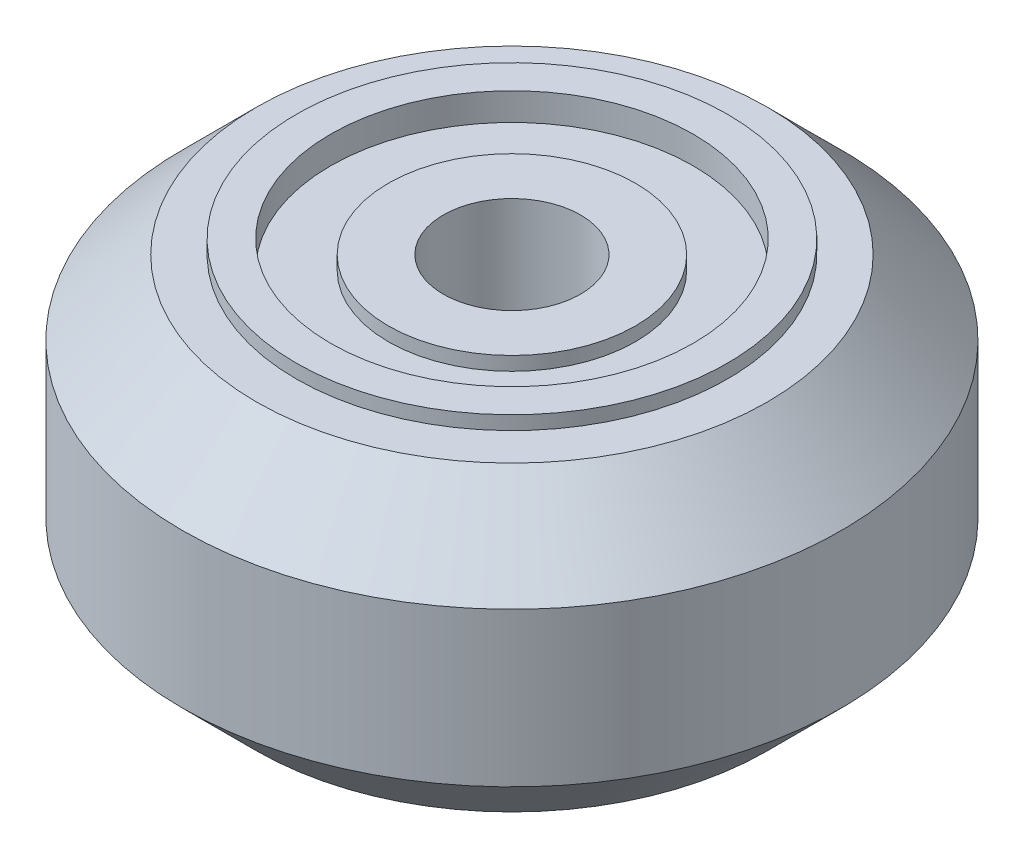
ISO-10303-21;
HEADER;
FILE_DESCRIPTION(('STEP AP214'),'2;1');
FILE_NAME('part.step','',(''),(''),'','','');
FILE_SCHEMA(('AUTOMOTIVE_DESIGN { 1 0 10303 214 1 1 1 1 }'));
ENDSEC;
DATA;
#1=APPLICATION_CONTEXT('core data for automotive mechanical design processes');
#2=APPLICATION_PROTOCOL_DEFINITION('international standard','automotive_design',2000,#1);
#3=PRODUCT_CONTEXT('',#1,'mechanical');
#4=PRODUCT('Part','Part','',(#3));
#5=PRODUCT_RELATED_PRODUCT_CATEGORY('part','',(#4));
#6=PRODUCT_DEFINITION_FORMATION('','',#4);
#7=PRODUCT_DEFINITION_CONTEXT('part definition',#1,'design');
#8=PRODUCT_DEFINITION('design','',#6,#7);
#9=PRODUCT_DEFINITION_SHAPE('','',#8);
#10=(LENGTH_UNIT() NAMED_UNIT(*) SI_UNIT(.MILLI.,.METRE.));
#11=(NAMED_UNIT(*) PLANE_ANGLE_UNIT() SI_UNIT($,.RADIAN.));
#12=(NAMED_UNIT(*) SI_UNIT($,.STERADIAN.) SOLID_ANGLE_UNIT());
#13=UNCERTAINTY_MEASURE_WITH_UNIT(LENGTH_MEASURE(1.E-05),#10,'distance_accuracy_value','');
#14=(GEOMETRIC_REPRESENTATION_CONTEXT(3) GLOBAL_UNCERTAINTY_ASSIGNED_CONTEXT((#13)) GLOBAL_UNIT_ASSIGNED_CONTEXT((#10,
#11,#12)) REPRESENTATION_CONTEXT('',''));
#15=CARTESIAN_POINT('',(0.,0.,0.));
#16=DIRECTION('',(0.,0.,1.));
#17=DIRECTION('',(1.,0.,0.));
#18=AXIS2_PLACEMENT_3D('',#15,#16,#17);
#19=CARTESIAN_POINT('',(0.,11.,0.));
#20=DIRECTION('',(0.,1.,0.));
#21=DIRECTION('',(0.,0.,1.));
#22=AXIS2_PLACEMENT_3D('',#19,#20,#21);
#23=PLANE('',#22);
#24=CARTESIAN_POINT('',(0.,11.,0.));
#25=DIRECTION('',(0.,-1.,0.));
#26=DIRECTION('',(0.,0.,-1.));
#27=AXIS2_PLACEMENT_3D('',#24,#25,#26);
#28=CIRCLE('',#27,2.5);
#29=CARTESIAN_POINT('',(0.,11.,-2.5));
#30=VERTEX_POINT('',#29);
#31=EDGE_CURVE('E68',#30,#30,#28,.T.);
#32=ORIENTED_EDGE('',*,*,#31,.T.);
#33=EDGE_LOOP('',(#32));
#34=FACE_BOUND('',#33,.T.);
#35=CARTESIAN_POINT('',(0.,11.,0.));
#36=DIRECTION('',(0.,-1.,0.));
#37=DIRECTION('',(0.,0.,-1.));
#38=AXIS2_PLACEMENT_3D('',#35,#36,#37);
#39=CIRCLE('',#38,4.5);
#40=CARTESIAN_POINT('',(0.,11.,-4.5));
#41=VERTEX_POINT('',#40);
#42=EDGE_CURVE('E127',#41,#41,#39,.T.);
#43=ORIENTED_EDGE('',*,*,#42,.F.);
#44=EDGE_LOOP('',(#43));
#45=FACE_BOUND('',#44,.T.);
#46=ADVANCED_FACE('F47',(#34,#45),#23,.T.);
#47=CARTESIAN_POINT('',(0.,0.,0.));
#48=DIRECTION('',(0.,1.,0.));
#49=DIRECTION('',(0.,0.,1.));
#50=AXIS2_PLACEMENT_3D('',#47,#48,#49);
#51=PLANE('',#50);
#52=CARTESIAN_POINT('',(0.,0.,0.));
#53=DIRECTION('',(0.,-1.,0.));
#54=DIRECTION('',(0.,0.,-1.));
#55=AXIS2_PLACEMENT_3D('',#52,#53,#54);
#56=CIRCLE('',#55,2.5);
#57=CARTESIAN_POINT('',(0.,0.,-2.5));
#58=VERTEX_POINT('',#57);
#59=EDGE_CURVE('E73',#58,#58,#56,.T.);
#60=ORIENTED_EDGE('',*,*,#59,.F.);
#61=EDGE_LOOP('',(#60));
#62=FACE_BOUND('',#61,.T.);
#63=CARTESIAN_POINT('',(0.,0.,0.));
#64=DIRECTION('',(0.,-1.,0.));
#65=DIRECTION('',(0.,0.,-1.));
#66=AXIS2_PLACEMENT_3D('',#63,#64,#65);
#67=CIRCLE('',#66,4.5);
#68=CARTESIAN_POINT('',(0.,0.,-4.5));
#69=VERTEX_POINT('',#68);
#70=EDGE_CURVE('E130',#69,#69,#67,.T.);
#71=ORIENTED_EDGE('',*,*,#70,.T.);
#72=EDGE_LOOP('',(#71));
#73=FACE_BOUND('',#72,.T.);
#74=ADVANCED_FACE('F99',(#62,#73),#51,.F.);
#75=CARTESIAN_POINT('',(0.,11.,0.));
#76=DIRECTION('',(0.,-1.,0.));
#77=DIRECTION('',(0.,0.,-1.));
#78=AXIS2_PLACEMENT_3D('',#75,#76,#77);
#79=CYLINDRICAL_SURFACE('',#78,12.);
#80=CARTESIAN_POINT('',(0.,2.7,0.));
#81=DIRECTION('',(0.,1.,0.));
#82=DIRECTION('',(0.,0.,1.));
#83=AXIS2_PLACEMENT_3D('',#80,#81,#82);
#84=CIRCLE('',#83,12.);
#85=CARTESIAN_POINT('',(0.,2.7,12.));
#86=VERTEX_POINT('',#85);
#87=EDGE_CURVE('E80',#86,#86,#84,.T.);
#88=ORIENTED_EDGE('',*,*,#87,.T.);
#89=EDGE_LOOP('',(#88));
#90=FACE_BOUND('',#89,.T.);
#91=CARTESIAN_POINT('',(0.,8.3,0.));
#92=DIRECTION('',(0.,1.,0.));
#93=DIRECTION('',(0.,0.,1.));
#94=AXIS2_PLACEMENT_3D('',#91,#92,#93);
#95=CIRCLE('',#94,12.);
#96=CARTESIAN_POINT('',(0.,8.3,12.));
#97=VERTEX_POINT('',#96);
#98=EDGE_CURVE('E72',#97,#97,#95,.F.);
#99=ORIENTED_EDGE('',*,*,#98,.T.);
#100=EDGE_LOOP('',(#99));
#101=FACE_BOUND('',#100,.T.);
#102=ADVANCED_FACE('F95',(#90,#101),#79,.T.);
#103=CARTESIAN_POINT('',(0.,11.,0.));
#104=DIRECTION('',(0.,1.,0.));
#105=DIRECTION('',(0.,0.,1.));
#106=AXIS2_PLACEMENT_3D('',#103,#104,#105);
#107=CIRCLE('',#106,7.85);
#108=CARTESIAN_POINT('',(0.,11.,7.85));
#109=VERTEX_POINT('',#108);
#110=EDGE_CURVE('E10',#109,#109,#107,.T.);
#111=ORIENTED_EDGE('',*,*,#110,.F.);
#112=EDGE_LOOP('',(#111));
#113=FACE_BOUND('',#112,.T.);
#114=CARTESIAN_POINT('',(0.,11.,0.));
#115=DIRECTION('',(0.,1.,0.));
#116=DIRECTION('',(0.,0.,1.));
#117=AXIS2_PLACEMENT_3D('',#114,#115,#116);
#118=CIRCLE('',#117,9.30000000000001);
#119=CARTESIAN_POINT('',(0.,11.,9.30000000000001));
#120=VERTEX_POINT('',#119);
#121=EDGE_CURVE('E57',#120,#120,#118,.T.);
#122=ORIENTED_EDGE('',*,*,#121,.T.);
#123=EDGE_LOOP('',(#122));
#124=FACE_BOUND('',#123,.T.);
#125=ADVANCED_FACE('F98',(#113,#124),#23,.T.);
#126=CARTESIAN_POINT('',(0.,0.,0.));
#127=DIRECTION('',(0.,1.,0.));
#128=DIRECTION('',(0.,0.,1.));
#129=AXIS2_PLACEMENT_3D('',#126,#127,#128);
#130=CIRCLE('',#129,7.85);
#131=CARTESIAN_POINT('',(0.,0.,7.85));
#132=VERTEX_POINT('',#131);
#133=EDGE_CURVE('E52',#132,#132,#130,.T.);
#134=ORIENTED_EDGE('',*,*,#133,.T.);
#135=EDGE_LOOP('',(#134));
#136=FACE_BOUND('',#135,.T.);
#137=CARTESIAN_POINT('',(0.,0.,0.));
#138=DIRECTION('',(0.,1.,0.));
#139=DIRECTION('',(0.,0.,1.));
#140=AXIS2_PLACEMENT_3D('',#137,#138,#139);
#141=CIRCLE('',#140,9.29999999999999);
#142=CARTESIAN_POINT('',(0.,0.,9.29999999999999));
#143=VERTEX_POINT('',#142);
#144=EDGE_CURVE('E63',#143,#143,#141,.F.);
#145=ORIENTED_EDGE('',*,*,#144,.T.);
#146=EDGE_LOOP('',(#145));
#147=FACE_BOUND('',#146,.T.);
#148=ADVANCED_FACE('F88',(#136,#147),#51,.F.);
#149=CARTESIAN_POINT('',(0.,2.7,0.));
#150=DIRECTION('',(0.,1.,0.));
#151=DIRECTION('',(0.,0.,1.));
#152=AXIS2_PLACEMENT_3D('',#149,#150,#151);
#153=CONICAL_SURFACE('',#152,12.,0.78539816339745);
#154=ORIENTED_EDGE('',*,*,#144,.F.);
#155=EDGE_LOOP('',(#154));
#156=FACE_BOUND('',#155,.T.);
#157=ORIENTED_EDGE('',*,*,#87,.F.);
#158=EDGE_LOOP('',(#157));
#159=FACE_BOUND('',#158,.T.);
#160=ADVANCED_FACE('F90',(#156,#159),#153,.T.);
#161=CARTESIAN_POINT('',(0.,11.,0.));
#162=DIRECTION('',(0.,-1.,0.));
#163=DIRECTION('',(0.,0.,-1.));
#164=AXIS2_PLACEMENT_3D('',#161,#162,#163);
#165=CONICAL_SURFACE('',#164,9.30000000000001,0.785398163397447);
#166=ORIENTED_EDGE('',*,*,#98,.F.);
#167=EDGE_LOOP('',(#166));
#168=FACE_BOUND('',#167,.T.);
#169=ORIENTED_EDGE('',*,*,#121,.F.);
#170=EDGE_LOOP('',(#169));
#171=FACE_BOUND('',#170,.T.);
#172=ADVANCED_FACE('F50',(#168,#171),#165,.T.);
#173=CARTESIAN_POINT('',(0.,11.5,0.));
#174=DIRECTION('',(0.,-1.,0.));
#175=DIRECTION('',(0.,0.,-1.));
#176=AXIS2_PLACEMENT_3D('',#173,#174,#175);
#177=CYLINDRICAL_SURFACE('',#176,6.6);
#178=CARTESIAN_POINT('',(0.,-0.5,0.));
#179=DIRECTION('',(0.,-1.,0.));
#180=DIRECTION('',(0.,0.,-1.));
#181=AXIS2_PLACEMENT_3D('',#178,#179,#180);
#182=CIRCLE('',#181,6.6);
#183=CARTESIAN_POINT('',(0.,-0.5,-6.6));
#184=VERTEX_POINT('',#183);
#185=EDGE_CURVE('E151',#184,#184,#182,.T.);
#186=ORIENTED_EDGE('',*,*,#185,.T.);
#187=EDGE_LOOP('',(#186));
#188=FACE_BOUND('',#187,.T.);
#189=CARTESIAN_POINT('',(0.,0.5,0.));
#190=DIRECTION('',(0.,-1.,0.));
#191=DIRECTION('',(0.,0.,-1.));
#192=AXIS2_PLACEMENT_3D('',#189,#190,#191);
#193=CIRCLE('',#192,6.6);
#194=CARTESIAN_POINT('',(0.,0.5,-6.6));
#195=VERTEX_POINT('',#194);
#196=EDGE_CURVE('E148',#195,#195,#193,.T.);
#197=ORIENTED_EDGE('',*,*,#196,.F.);
#198=EDGE_LOOP('',(#197));
#199=FACE_BOUND('',#198,.T.);
#200=ADVANCED_FACE('F105',(#188,#199),#177,.F.);
#201=CARTESIAN_POINT('',(0.,-0.5,0.));
#202=DIRECTION('',(0.,-1.,0.));
#203=DIRECTION('',(0.,0.,-1.));
#204=AXIS2_PLACEMENT_3D('',#201,#202,#203);
#205=PLANE('',#204);
#206=ORIENTED_EDGE('',*,*,#185,.F.);
#207=EDGE_LOOP('',(#206));
#208=FACE_BOUND('',#207,.T.);
#209=CARTESIAN_POINT('',(0.,-0.5,0.));
#210=DIRECTION('',(0.,-1.,0.));
#211=DIRECTION('',(0.,0.,-1.));
#212=AXIS2_PLACEMENT_3D('',#209,#210,#211);
#213=CIRCLE('',#212,7.85);
#214=CARTESIAN_POINT('',(0.,-0.5,-7.85));
#215=VERTEX_POINT('',#214);
#216=EDGE_CURVE('E156',#215,#215,#213,.T.);
#217=ORIENTED_EDGE('',*,*,#216,.T.);
#218=EDGE_LOOP('',(#217));
#219=FACE_BOUND('',#218,.T.);
#220=ADVANCED_FACE('F175',(#208,#219),#205,.T.);
#221=CARTESIAN_POINT('',(0.,11.5,0.));
#222=DIRECTION('',(0.,-1.,0.));
#223=DIRECTION('',(0.,0.,-1.));
#224=AXIS2_PLACEMENT_3D('',#221,#222,#223);
#225=CYLINDRICAL_SURFACE('',#224,7.85);
#226=ORIENTED_EDGE('',*,*,#216,.F.);
#227=EDGE_LOOP('',(#226));
#228=FACE_BOUND('',#227,.T.);
#229=ORIENTED_EDGE('',*,*,#133,.F.);
#230=EDGE_LOOP('',(#229));
#231=FACE_BOUND('',#230,.T.);
#232=ADVANCED_FACE('F172',(#228,#231),#225,.T.);
#233=CARTESIAN_POINT('',(0.,11.,0.));
#234=DIRECTION('',(0.,-1.,0.));
#235=DIRECTION('',(0.,0.,-1.));
#236=AXIS2_PLACEMENT_3D('',#233,#234,#235);
#237=CYLINDRICAL_SURFACE('',#236,2.5);
#238=ORIENTED_EDGE('',*,*,#31,.F.);
#239=EDGE_LOOP('',(#238));
#240=FACE_BOUND('',#239,.T.);
#241=ORIENTED_EDGE('',*,*,#59,.T.);
#242=EDGE_LOOP('',(#241));
#243=FACE_BOUND('',#242,.T.);
#244=ADVANCED_FACE('F174',(#240,#243),#237,.F.);
#245=CARTESIAN_POINT('',(0.,11.5,0.));
#246=DIRECTION('',(0.,-1.,0.));
#247=DIRECTION('',(0.,0.,-1.));
#248=AXIS2_PLACEMENT_3D('',#245,#246,#247);
#249=CIRCLE('',#248,6.6);
#250=CARTESIAN_POINT('',(0.,11.5,-6.6));
#251=VERTEX_POINT('',#250);
#252=EDGE_CURVE('E159',#251,#251,#249,.T.);
#253=ORIENTED_EDGE('',*,*,#252,.F.);
#254=EDGE_LOOP('',(#253));
#255=FACE_BOUND('',#254,.T.);
#256=CARTESIAN_POINT('',(0.,10.5,0.));
#257=DIRECTION('',(0.,-1.,0.));
#258=DIRECTION('',(0.,0.,-1.));
#259=AXIS2_PLACEMENT_3D('',#256,#257,#258);
#260=CIRCLE('',#259,6.6);
#261=CARTESIAN_POINT('',(0.,10.5,-6.6));
#262=VERTEX_POINT('',#261);
#263=EDGE_CURVE('E131',#262,#262,#260,.T.);
#264=ORIENTED_EDGE('',*,*,#263,.T.);
#265=EDGE_LOOP('',(#264));
#266=FACE_BOUND('',#265,.T.);
#267=ADVANCED_FACE('F183',(#255,#266),#177,.F.);
#268=ORIENTED_EDGE('',*,*,#110,.T.);
#269=EDGE_LOOP('',(#268));
#270=FACE_BOUND('',#269,.T.);
#271=CARTESIAN_POINT('',(0.,11.5,0.));
#272=DIRECTION('',(0.,-1.,0.));
#273=DIRECTION('',(0.,0.,-1.));
#274=AXIS2_PLACEMENT_3D('',#271,#272,#273);
#275=CIRCLE('',#274,7.85);
#276=CARTESIAN_POINT('',(0.,11.5,-7.85));
#277=VERTEX_POINT('',#276);
#278=EDGE_CURVE('E66',#277,#277,#275,.T.);
#279=ORIENTED_EDGE('',*,*,#278,.T.);
#280=EDGE_LOOP('',(#279));
#281=FACE_BOUND('',#280,.T.);
#282=ADVANCED_FACE('F178',(#270,#281),#225,.T.);
#283=CARTESIAN_POINT('',(0.,11.5,0.));
#284=DIRECTION('',(0.,-1.,0.));
#285=DIRECTION('',(0.,0.,-1.));
#286=AXIS2_PLACEMENT_3D('',#283,#284,#285);
#287=PLANE('',#286);
#288=ORIENTED_EDGE('',*,*,#252,.T.);
#289=EDGE_LOOP('',(#288));
#290=FACE_BOUND('',#289,.T.);
#291=ORIENTED_EDGE('',*,*,#278,.F.);
#292=EDGE_LOOP('',(#291));
#293=FACE_BOUND('',#292,.T.);
#294=ADVANCED_FACE('F191',(#290,#293),#287,.F.);
#295=CARTESIAN_POINT('',(0.,0.5,0.));
#296=DIRECTION('',(0.,-1.,0.));
#297=DIRECTION('',(0.,0.,-1.));
#298=AXIS2_PLACEMENT_3D('',#295,#296,#297);
#299=CYLINDRICAL_SURFACE('',#298,4.5);
#300=CARTESIAN_POINT('',(0.,0.5,0.));
#301=DIRECTION('',(0.,-1.,0.));
#302=DIRECTION('',(0.,0.,-1.));
#303=AXIS2_PLACEMENT_3D('',#300,#301,#302);
#304=CIRCLE('',#303,4.5);
#305=CARTESIAN_POINT('',(0.,0.5,-4.5));
#306=VERTEX_POINT('',#305);
#307=EDGE_CURVE('E136',#306,#306,#304,.T.);
#308=ORIENTED_EDGE('',*,*,#307,.T.);
#309=EDGE_LOOP('',(#308));
#310=FACE_BOUND('',#309,.T.);
#311=ORIENTED_EDGE('',*,*,#70,.F.);
#312=EDGE_LOOP('',(#311));
#313=FACE_BOUND('',#312,.T.);
#314=ADVANCED_FACE('F196',(#310,#313),#299,.T.);
#315=CARTESIAN_POINT('',(0.,0.5,0.));
#316=DIRECTION('',(0.,-1.,0.));
#317=DIRECTION('',(0.,0.,-1.));
#318=AXIS2_PLACEMENT_3D('',#315,#316,#317);
#319=PLANE('',#318);
#320=ORIENTED_EDGE('',*,*,#307,.F.);
#321=EDGE_LOOP('',(#320));
#322=FACE_BOUND('',#321,.T.);
#323=ORIENTED_EDGE('',*,*,#196,.T.);
#324=EDGE_LOOP('',(#323));
#325=FACE_BOUND('',#324,.T.);
#326=ADVANCED_FACE('F209',(#322,#325),#319,.T.);
#327=CARTESIAN_POINT('',(0.,11.,0.));
#328=DIRECTION('',(0.,-1.,0.));
#329=DIRECTION('',(0.,0.,-1.));
#330=AXIS2_PLACEMENT_3D('',#327,#328,#329);
#331=CYLINDRICAL_SURFACE('',#330,4.5);
#332=ORIENTED_EDGE('',*,*,#42,.T.);
#333=EDGE_LOOP('',(#332));
#334=FACE_BOUND('',#333,.T.);
#335=CARTESIAN_POINT('',(0.,10.5,0.));
#336=DIRECTION('',(0.,-1.,0.));
#337=DIRECTION('',(0.,0.,-1.));
#338=AXIS2_PLACEMENT_3D('',#335,#336,#337);
#339=CIRCLE('',#338,4.5);
#340=CARTESIAN_POINT('',(0.,10.5,-4.5));
#341=VERTEX_POINT('',#340);
#342=EDGE_CURVE('E139',#341,#341,#339,.T.);
#343=ORIENTED_EDGE('',*,*,#342,.F.);
#344=EDGE_LOOP('',(#343));
#345=FACE_BOUND('',#344,.T.);
#346=ADVANCED_FACE('F211',(#334,#345),#331,.T.);
#347=CARTESIAN_POINT('',(0.,10.5,0.));
#348=DIRECTION('',(0.,-1.,0.));
#349=DIRECTION('',(0.,0.,-1.));
#350=AXIS2_PLACEMENT_3D('',#347,#348,#349);
#351=PLANE('',#350);
#352=ORIENTED_EDGE('',*,*,#342,.T.);
#353=EDGE_LOOP('',(#352));
#354=FACE_BOUND('',#353,.T.);
#355=ORIENTED_EDGE('',*,*,#263,.F.);
#356=EDGE_LOOP('',(#355));
#357=FACE_BOUND('',#356,.T.);
#358=ADVANCED_FACE('F218',(#354,#357),#351,.F.);
#359=CLOSED_SHELL('',(#46,#74,#102,#125,#148,#160,#172,#200,#220,#232,#244,#267,#282,#294,#314,
#326,#346,#358));
#360=MANIFOLD_SOLID_BREP('B2',#359);
#361=ADVANCED_BREP_SHAPE_REPRESENTATION('',(#18,#360),#14);
#362=SHAPE_DEFINITION_REPRESENTATION(#9,#361);
ENDSEC;
END-ISO-10303-21;
